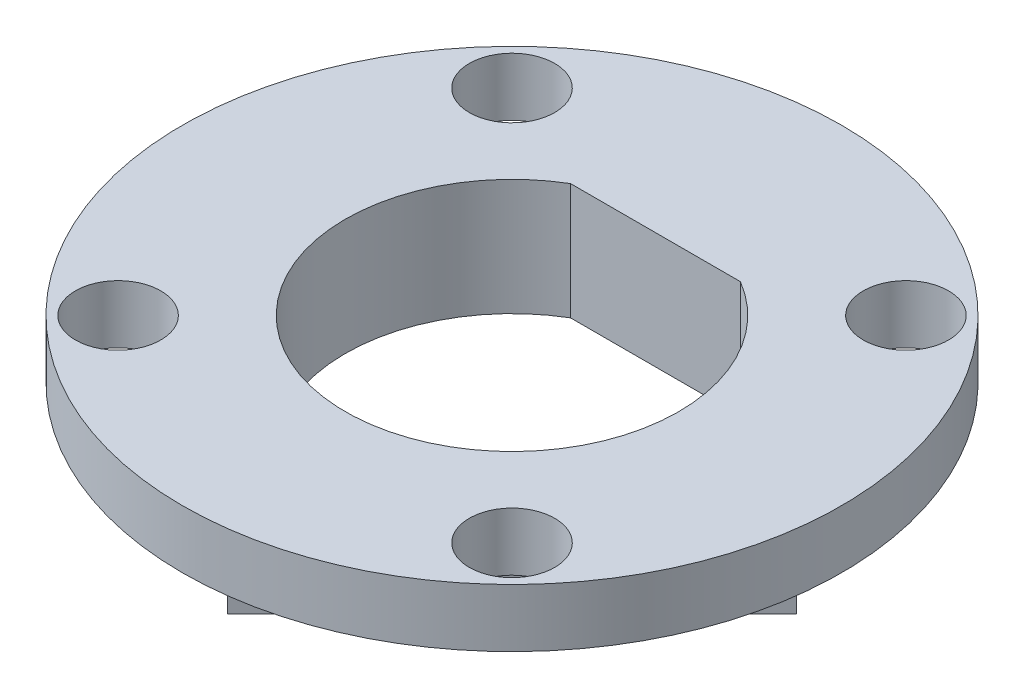
ISO-10303-21;
HEADER;
FILE_DESCRIPTION(('STEP AP214'),'2;1');
FILE_NAME('part.step','',(''),(''),'','','');
FILE_SCHEMA(('AUTOMOTIVE_DESIGN { 1 0 10303 214 1 1 1 1 }'));
ENDSEC;
DATA;
#1=APPLICATION_CONTEXT('core data for automotive mechanical design processes');
#2=APPLICATION_PROTOCOL_DEFINITION('international standard','automotive_design',2000,#1);
#3=PRODUCT_CONTEXT('',#1,'mechanical');
#4=PRODUCT('Part','Part','',(#3));
#5=PRODUCT_RELATED_PRODUCT_CATEGORY('part','',(#4));
#6=PRODUCT_DEFINITION_FORMATION('','',#4);
#7=PRODUCT_DEFINITION_CONTEXT('part definition',#1,'design');
#8=PRODUCT_DEFINITION('design','',#6,#7);
#9=PRODUCT_DEFINITION_SHAPE('','',#8);
#10=(LENGTH_UNIT() NAMED_UNIT(*) SI_UNIT(.MILLI.,.METRE.));
#11=(NAMED_UNIT(*) PLANE_ANGLE_UNIT() SI_UNIT($,.RADIAN.));
#12=(NAMED_UNIT(*) SI_UNIT($,.STERADIAN.) SOLID_ANGLE_UNIT());
#13=UNCERTAINTY_MEASURE_WITH_UNIT(LENGTH_MEASURE(1.E-05),#10,'distance_accuracy_value','');
#14=(GEOMETRIC_REPRESENTATION_CONTEXT(3) GLOBAL_UNCERTAINTY_ASSIGNED_CONTEXT((#13)) GLOBAL_UNIT_ASSIGNED_CONTEXT((#10,
#11,#12)) REPRESENTATION_CONTEXT('',''));
#15=CARTESIAN_POINT('',(0.,0.,0.));
#16=DIRECTION('',(0.,0.,1.));
#17=DIRECTION('',(1.,0.,0.));
#18=AXIS2_PLACEMENT_3D('',#15,#16,#17);
#19=CARTESIAN_POINT('',(0.,3.,0.));
#20=DIRECTION('',(0.,-1.,0.));
#21=DIRECTION('',(0.,0.,-1.));
#22=AXIS2_PLACEMENT_3D('',#19,#20,#21);
#23=CYLINDRICAL_SURFACE('',#22,8.5);
#24=CARTESIAN_POINT('',(0.,3.,0.));
#25=DIRECTION('',(0.,1.,0.));
#26=DIRECTION('',(0.,0.,1.));
#27=AXIS2_PLACEMENT_3D('',#24,#25,#26);
#28=CIRCLE('',#27,8.5);
#29=CARTESIAN_POINT('',(0.,3.,8.5));
#30=VERTEX_POINT('',#29);
#31=EDGE_CURVE('E157',#30,#30,#28,.T.);
#32=ORIENTED_EDGE('',*,*,#31,.F.);
#33=EDGE_LOOP('',(#32));
#34=FACE_BOUND('',#33,.T.);
#35=CARTESIAN_POINT('',(0.,1.5,0.));
#36=DIRECTION('',(0.,-1.,0.));
#37=DIRECTION('',(0.,0.,1.));
#38=AXIS2_PLACEMENT_3D('',#35,#36,#37);
#39=CIRCLE('',#38,8.5);
#40=CARTESIAN_POINT('',(0.,1.5,8.5));
#41=VERTEX_POINT('',#40);
#42=EDGE_CURVE('E124',#41,#41,#39,.T.);
#43=ORIENTED_EDGE('',*,*,#42,.F.);
#44=EDGE_LOOP('',(#43));
#45=FACE_BOUND('',#44,.T.);
#46=ADVANCED_FACE('F33',(#34,#45),#23,.T.);
#47=CARTESIAN_POINT('',(0.,3.,0.));
#48=DIRECTION('',(0.,1.,0.));
#49=DIRECTION('',(0.,0.,1.));
#50=AXIS2_PLACEMENT_3D('',#47,#48,#49);
#51=PLANE('',#50);
#52=CARTESIAN_POINT('',(-5.07999999999621,3.,-5.07999999999621));
#53=DIRECTION('',(0.,1.,0.));
#54=DIRECTION('',(0.,0.,1.));
#55=AXIS2_PLACEMENT_3D('',#52,#53,#54);
#56=CIRCLE('',#55,1.1);
#57=CARTESIAN_POINT('',(-5.07999999999621,3.,-3.97999999999621));
#58=VERTEX_POINT('',#57);
#59=EDGE_CURVE('E132',#58,#58,#56,.T.);
#60=ORIENTED_EDGE('',*,*,#59,.F.);
#61=EDGE_LOOP('',(#60));
#62=FACE_BOUND('',#61,.T.);
#63=CARTESIAN_POINT('',(5.07999999999621,3.,5.07999999999621));
#64=DIRECTION('',(0.,1.,0.));
#65=DIRECTION('',(0.,0.,1.));
#66=AXIS2_PLACEMENT_3D('',#63,#64,#65);
#67=CIRCLE('',#66,1.1);
#68=CARTESIAN_POINT('',(5.07999999999621,3.,6.17999999999621));
#69=VERTEX_POINT('',#68);
#70=EDGE_CURVE('E135',#69,#69,#67,.T.);
#71=ORIENTED_EDGE('',*,*,#70,.F.);
#72=EDGE_LOOP('',(#71));
#73=FACE_BOUND('',#72,.T.);
#74=CARTESIAN_POINT('',(-5.07999999999621,3.,5.07999999999621));
#75=DIRECTION('',(0.,1.,0.));
#76=DIRECTION('',(0.,0.,1.));
#77=AXIS2_PLACEMENT_3D('',#74,#75,#76);
#78=CIRCLE('',#77,1.1);
#79=CARTESIAN_POINT('',(-5.07999999999621,3.,6.17999999999621));
#80=VERTEX_POINT('',#79);
#81=EDGE_CURVE('E138',#80,#80,#78,.T.);
#82=ORIENTED_EDGE('',*,*,#81,.F.);
#83=EDGE_LOOP('',(#82));
#84=FACE_BOUND('',#83,.T.);
#85=CARTESIAN_POINT('',(5.07999999999621,3.,-5.07999999999621));
#86=DIRECTION('',(0.,1.,0.));
#87=DIRECTION('',(0.,0.,1.));
#88=AXIS2_PLACEMENT_3D('',#85,#86,#87);
#89=CIRCLE('',#88,1.1);
#90=CARTESIAN_POINT('',(5.07999999999621,3.,-3.97999999999621));
#91=VERTEX_POINT('',#90);
#92=EDGE_CURVE('E141',#91,#91,#89,.T.);
#93=ORIENTED_EDGE('',*,*,#92,.F.);
#94=EDGE_LOOP('',(#93));
#95=FACE_BOUND('',#94,.T.);
#96=CARTESIAN_POINT('',(0.,3.,0.));
#97=DIRECTION('',(0.,1.,0.));
#98=DIRECTION('',(0.,0.,1.));
#99=AXIS2_PLACEMENT_3D('',#96,#97,#98);
#100=CIRCLE('',#99,4.3);
#101=CARTESIAN_POINT('',(-2.19089023002066,3.,-3.7));
#102=VERTEX_POINT('',#101);
#103=CARTESIAN_POINT('',(2.19089023002066,3.,-3.7));
#104=VERTEX_POINT('',#103);
#105=EDGE_CURVE('E55',#102,#104,#100,.T.);
#106=ORIENTED_EDGE('',*,*,#105,.F.);
#107=DIRECTION('',(-1.,0.,0.));
#108=VECTOR('',#107,1.);
#109=CARTESIAN_POINT('',(-2.19089023002066,3.,-3.7));
#110=LINE('',#109,#108);
#111=EDGE_CURVE('E148',#104,#102,#110,.T.);
#112=ORIENTED_EDGE('',*,*,#111,.F.);
#113=EDGE_LOOP('',(#106,#112));
#114=FACE_BOUND('',#113,.T.);
#115=ORIENTED_EDGE('',*,*,#31,.T.);
#116=EDGE_LOOP('',(#115));
#117=FACE_BOUND('',#116,.T.);
#118=ADVANCED_FACE('F181',(#62,#73,#84,#95,#114,#117),#51,.T.);
#119=CARTESIAN_POINT('',(0.,0.,0.));
#120=DIRECTION('',(0.,1.,0.));
#121=DIRECTION('',(0.,0.,1.));
#122=AXIS2_PLACEMENT_3D('',#119,#120,#121);
#123=PLANE('',#122);
#124=DIRECTION('',(-1.,0.,0.));
#125=VECTOR('',#124,1.);
#126=CARTESIAN_POINT('',(-2.19089023002066,0.,-3.7));
#127=LINE('',#126,#125);
#128=CARTESIAN_POINT('',(2.19089023002066,0.,-3.7));
#129=VERTEX_POINT('',#128);
#130=CARTESIAN_POINT('',(-2.19089023002066,0.,-3.7));
#131=VERTEX_POINT('',#130);
#132=EDGE_CURVE('E147',#129,#131,#127,.T.);
#133=ORIENTED_EDGE('',*,*,#132,.T.);
#134=CARTESIAN_POINT('',(0.,0.,0.));
#135=DIRECTION('',(0.,1.,0.));
#136=DIRECTION('',(0.,0.,1.));
#137=AXIS2_PLACEMENT_3D('',#134,#135,#136);
#138=CIRCLE('',#137,4.3);
#139=EDGE_CURVE('E144',#131,#129,#138,.T.);
#140=ORIENTED_EDGE('',*,*,#139,.T.);
#141=EDGE_LOOP('',(#133,#140));
#142=FACE_BOUND('',#141,.T.);
#143=DIRECTION('',(-0.707106781186546,0.,-0.707106781186549));
#144=VECTOR('',#143,1.);
#145=CARTESIAN_POINT('',(-1.0973018246194,0.,-8.42887469984499));
#146=LINE('',#145,#144);
#147=CARTESIAN_POINT('',(7.33157287522555,0.,0.));
#148=VERTEX_POINT('',#147);
#149=CARTESIAN_POINT('',(0.,0.,-7.33157287522561));
#150=VERTEX_POINT('',#149);
#151=EDGE_CURVE('E87',#148,#150,#146,.T.);
#152=ORIENTED_EDGE('',*,*,#151,.F.);
#153=DIRECTION('',(0.707106781186546,0.,-0.707106781186549));
#154=VECTOR('',#153,1.);
#155=CARTESIAN_POINT('',(8.42887469984498,0.,-1.09730182461943));
#156=LINE('',#155,#154);
#157=CARTESIAN_POINT('',(0.,0.,7.33157287522558));
#158=VERTEX_POINT('',#157);
#159=EDGE_CURVE('E111',#158,#148,#156,.T.);
#160=ORIENTED_EDGE('',*,*,#159,.F.);
#161=DIRECTION('',(0.707106781186546,0.,0.707106781186549));
#162=VECTOR('',#161,1.);
#163=CARTESIAN_POINT('',(1.0973018246194,0.,8.42887469984499));
#164=LINE('',#163,#162);
#165=CARTESIAN_POINT('',(-7.33157287522553,0.,0.));
#166=VERTEX_POINT('',#165);
#167=EDGE_CURVE('E105',#166,#158,#164,.T.);
#168=ORIENTED_EDGE('',*,*,#167,.F.);
#169=DIRECTION('',(-0.707106781186541,0.,0.707106781186554));
#170=VECTOR('',#169,1.);
#171=CARTESIAN_POINT('',(-8.42887469984498,0.,1.09730182461949));
#172=LINE('',#171,#170);
#173=EDGE_CURVE('E47',#150,#166,#172,.T.);
#174=ORIENTED_EDGE('',*,*,#173,.F.);
#175=EDGE_LOOP('',(#152,#160,#168,#174));
#176=FACE_BOUND('',#175,.T.);
#177=ADVANCED_FACE('F103',(#142,#176),#123,.F.);
#178=CARTESIAN_POINT('',(0.,0.,0.));
#179=DIRECTION('',(0.,1.,0.));
#180=DIRECTION('',(0.,0.,1.));
#181=AXIS2_PLACEMENT_3D('',#178,#179,#180);
#182=CYLINDRICAL_SURFACE('',#181,4.3);
#183=ORIENTED_EDGE('',*,*,#105,.T.);
#184=DIRECTION('',(0.,1.,0.));
#185=VECTOR('',#184,1.);
#186=CARTESIAN_POINT('',(2.19089023002066,0.,-3.7));
#187=LINE('',#186,#185);
#188=EDGE_CURVE('E151',#129,#104,#187,.T.);
#189=ORIENTED_EDGE('',*,*,#188,.F.);
#190=ORIENTED_EDGE('',*,*,#139,.F.);
#191=DIRECTION('',(0.,1.,0.));
#192=VECTOR('',#191,1.);
#193=CARTESIAN_POINT('',(-2.19089023002066,0.,-3.7));
#194=LINE('',#193,#192);
#195=EDGE_CURVE('E155',#131,#102,#194,.T.);
#196=ORIENTED_EDGE('',*,*,#195,.T.);
#197=EDGE_LOOP('',(#183,#189,#190,#196));
#198=FACE_BOUND('',#197,.T.);
#199=ADVANCED_FACE('F215',(#198),#182,.F.);
#200=CARTESIAN_POINT('',(-2.19089023002066,0.,-3.7));
#201=DIRECTION('',(0.,0.,-1.));
#202=DIRECTION('',(-1.,0.,0.));
#203=AXIS2_PLACEMENT_3D('',#200,#201,#202);
#204=PLANE('',#203);
#205=ORIENTED_EDGE('',*,*,#111,.T.);
#206=ORIENTED_EDGE('',*,*,#195,.F.);
#207=ORIENTED_EDGE('',*,*,#132,.F.);
#208=ORIENTED_EDGE('',*,*,#188,.T.);
#209=EDGE_LOOP('',(#205,#206,#207,#208));
#210=FACE_BOUND('',#209,.T.);
#211=ADVANCED_FACE('F211',(#210),#204,.F.);
#212=CARTESIAN_POINT('',(5.07999999999621,0.,-5.07999999999621));
#213=DIRECTION('',(0.,1.,0.));
#214=DIRECTION('',(0.,0.,1.));
#215=AXIS2_PLACEMENT_3D('',#212,#213,#214);
#216=CYLINDRICAL_SURFACE('',#215,1.1);
#217=CARTESIAN_POINT('',(5.07999999999621,1.5,-5.07999999999621));
#218=DIRECTION('',(0.,1.,0.));
#219=DIRECTION('',(0.,0.,1.));
#220=AXIS2_PLACEMENT_3D('',#217,#218,#219);
#221=CIRCLE('',#220,1.1);
#222=CARTESIAN_POINT('',(5.07999999999621,1.5,-3.97999999999621));
#223=VERTEX_POINT('',#222);
#224=EDGE_CURVE('E121',#223,#223,#221,.F.);
#225=ORIENTED_EDGE('',*,*,#224,.T.);
#226=EDGE_LOOP('',(#225));
#227=FACE_BOUND('',#226,.T.);
#228=ORIENTED_EDGE('',*,*,#92,.T.);
#229=EDGE_LOOP('',(#228));
#230=FACE_BOUND('',#229,.T.);
#231=ADVANCED_FACE('F207',(#227,#230),#216,.F.);
#232=CARTESIAN_POINT('',(-5.07999999999621,0.,5.07999999999621));
#233=DIRECTION('',(0.,1.,0.));
#234=DIRECTION('',(0.,0.,1.));
#235=AXIS2_PLACEMENT_3D('',#232,#233,#234);
#236=CYLINDRICAL_SURFACE('',#235,1.1);
#237=CARTESIAN_POINT('',(-5.07999999999621,1.5,5.07999999999621));
#238=DIRECTION('',(0.,1.,0.));
#239=DIRECTION('',(0.,0.,1.));
#240=AXIS2_PLACEMENT_3D('',#237,#238,#239);
#241=CIRCLE('',#240,1.1);
#242=CARTESIAN_POINT('',(-5.07999999999621,1.5,6.17999999999621));
#243=VERTEX_POINT('',#242);
#244=EDGE_CURVE('E130',#243,#243,#241,.F.);
#245=ORIENTED_EDGE('',*,*,#244,.T.);
#246=EDGE_LOOP('',(#245));
#247=FACE_BOUND('',#246,.T.);
#248=ORIENTED_EDGE('',*,*,#81,.T.);
#249=EDGE_LOOP('',(#248));
#250=FACE_BOUND('',#249,.T.);
#251=ADVANCED_FACE('F203',(#247,#250),#236,.F.);
#252=CARTESIAN_POINT('',(5.07999999999621,0.,5.07999999999621));
#253=DIRECTION('',(0.,1.,0.));
#254=DIRECTION('',(0.,0.,1.));
#255=AXIS2_PLACEMENT_3D('',#252,#253,#254);
#256=CYLINDRICAL_SURFACE('',#255,1.1);
#257=CARTESIAN_POINT('',(5.07999999999621,1.5,5.07999999999621));
#258=DIRECTION('',(0.,1.,0.));
#259=DIRECTION('',(0.,0.,1.));
#260=AXIS2_PLACEMENT_3D('',#257,#258,#259);
#261=CIRCLE('',#260,1.1);
#262=CARTESIAN_POINT('',(5.07999999999621,1.5,6.17999999999621));
#263=VERTEX_POINT('',#262);
#264=EDGE_CURVE('E118',#263,#263,#261,.F.);
#265=ORIENTED_EDGE('',*,*,#264,.T.);
#266=EDGE_LOOP('',(#265));
#267=FACE_BOUND('',#266,.T.);
#268=ORIENTED_EDGE('',*,*,#70,.T.);
#269=EDGE_LOOP('',(#268));
#270=FACE_BOUND('',#269,.T.);
#271=ADVANCED_FACE('F197',(#267,#270),#256,.F.);
#272=CARTESIAN_POINT('',(-5.07999999999621,0.,-5.07999999999621));
#273=DIRECTION('',(0.,1.,0.));
#274=DIRECTION('',(0.,0.,1.));
#275=AXIS2_PLACEMENT_3D('',#272,#273,#274);
#276=CYLINDRICAL_SURFACE('',#275,1.1);
#277=CARTESIAN_POINT('',(-5.07999999999621,1.5,-5.07999999999621));
#278=DIRECTION('',(0.,1.,0.));
#279=DIRECTION('',(0.,0.,1.));
#280=AXIS2_PLACEMENT_3D('',#277,#278,#279);
#281=CIRCLE('',#280,1.1);
#282=CARTESIAN_POINT('',(-5.07999999999621,1.5,-3.97999999999621));
#283=VERTEX_POINT('',#282);
#284=EDGE_CURVE('E114',#283,#283,#281,.F.);
#285=ORIENTED_EDGE('',*,*,#284,.T.);
#286=EDGE_LOOP('',(#285));
#287=FACE_BOUND('',#286,.T.);
#288=ORIENTED_EDGE('',*,*,#59,.T.);
#289=EDGE_LOOP('',(#288));
#290=FACE_BOUND('',#289,.T.);
#291=ADVANCED_FACE('F193',(#287,#290),#276,.F.);
#292=CARTESIAN_POINT('',(0.,1.5,0.));
#293=DIRECTION('',(0.,1.,0.));
#294=DIRECTION('',(0.,0.,1.));
#295=AXIS2_PLACEMENT_3D('',#292,#293,#294);
#296=PLANE('',#295);
#297=ORIENTED_EDGE('',*,*,#42,.T.);
#298=EDGE_LOOP('',(#297));
#299=FACE_BOUND('',#298,.T.);
#300=DIRECTION('',(0.707106781186546,0.,0.707106781186549));
#301=VECTOR('',#300,1.);
#302=CARTESIAN_POINT('',(1.0973018246194,1.5,8.42887469984499));
#303=LINE('',#302,#301);
#304=CARTESIAN_POINT('',(-7.33157287522553,1.5,0.));
#305=VERTEX_POINT('',#304);
#306=CARTESIAN_POINT('',(0.,1.5,7.33157287522558));
#307=VERTEX_POINT('',#306);
#308=EDGE_CURVE('E127',#305,#307,#303,.T.);
#309=ORIENTED_EDGE('',*,*,#308,.T.);
#310=DIRECTION('',(0.707106781186546,0.,-0.707106781186549));
#311=VECTOR('',#310,1.);
#312=CARTESIAN_POINT('',(8.42887469984498,1.5,-1.09730182461943));
#313=LINE('',#312,#311);
#314=CARTESIAN_POINT('',(7.33157287522555,1.5,0.));
#315=VERTEX_POINT('',#314);
#316=EDGE_CURVE('E112',#307,#315,#313,.T.);
#317=ORIENTED_EDGE('',*,*,#316,.T.);
#318=DIRECTION('',(-0.707106781186546,0.,-0.707106781186549));
#319=VECTOR('',#318,1.);
#320=CARTESIAN_POINT('',(-1.0973018246194,1.5,-8.42887469984499));
#321=LINE('',#320,#319);
#322=CARTESIAN_POINT('',(0.,1.5,-7.33157287522561));
#323=VERTEX_POINT('',#322);
#324=EDGE_CURVE('E96',#315,#323,#321,.T.);
#325=ORIENTED_EDGE('',*,*,#324,.T.);
#326=DIRECTION('',(-0.707106781186541,0.,0.707106781186554));
#327=VECTOR('',#326,1.);
#328=CARTESIAN_POINT('',(-8.42887469984498,1.5,1.09730182461949));
#329=LINE('',#328,#327);
#330=EDGE_CURVE('E100',#323,#305,#329,.T.);
#331=ORIENTED_EDGE('',*,*,#330,.T.);
#332=EDGE_LOOP('',(#309,#317,#325,#331));
#333=FACE_BOUND('',#332,.T.);
#334=ORIENTED_EDGE('',*,*,#244,.F.);
#335=EDGE_LOOP('',(#334));
#336=FACE_BOUND('',#335,.T.);
#337=ORIENTED_EDGE('',*,*,#264,.F.);
#338=EDGE_LOOP('',(#337));
#339=FACE_BOUND('',#338,.T.);
#340=ORIENTED_EDGE('',*,*,#284,.F.);
#341=EDGE_LOOP('',(#340));
#342=FACE_BOUND('',#341,.T.);
#343=ORIENTED_EDGE('',*,*,#224,.F.);
#344=EDGE_LOOP('',(#343));
#345=FACE_BOUND('',#344,.T.);
#346=ADVANCED_FACE('F166',(#299,#333,#336,#339,#342,#345),#296,.F.);
#347=CARTESIAN_POINT('',(1.0973018246194,1.5,8.42887469984499));
#348=DIRECTION('',(0.707106781186549,0.,-0.707106781186546));
#349=DIRECTION('',(-0.707106781186546,0.,-0.707106781186549));
#350=AXIS2_PLACEMENT_3D('',#347,#348,#349);
#351=PLANE('',#350);
#352=ORIENTED_EDGE('',*,*,#167,.T.);
#353=DIRECTION('',(0.,1.,0.));
#354=VECTOR('',#353,1.);
#355=CARTESIAN_POINT('',(0.,1.5,7.33157287522558));
#356=LINE('',#355,#354);
#357=EDGE_CURVE('E11',#158,#307,#356,.T.);
#358=ORIENTED_EDGE('',*,*,#357,.T.);
#359=ORIENTED_EDGE('',*,*,#308,.F.);
#360=DIRECTION('',(0.,-1.,0.));
#361=VECTOR('',#360,1.);
#362=CARTESIAN_POINT('',(-7.33157287522553,1.5,0.));
#363=LINE('',#362,#361);
#364=EDGE_CURVE('E40',#305,#166,#363,.T.);
#365=ORIENTED_EDGE('',*,*,#364,.T.);
#366=EDGE_LOOP('',(#352,#358,#359,#365));
#367=FACE_BOUND('',#366,.T.);
#368=ADVANCED_FACE('F164',(#367),#351,.F.);
#369=CARTESIAN_POINT('',(8.42887469984498,1.5,-1.09730182461943));
#370=DIRECTION('',(-0.707106781186549,0.,-0.707106781186546));
#371=DIRECTION('',(-0.707106781186546,0.,0.707106781186549));
#372=AXIS2_PLACEMENT_3D('',#369,#370,#371);
#373=PLANE('',#372);
#374=ORIENTED_EDGE('',*,*,#159,.T.);
#375=DIRECTION('',(0.,1.,0.));
#376=VECTOR('',#375,1.);
#377=CARTESIAN_POINT('',(7.33157287522556,1.5,0.));
#378=LINE('',#377,#376);
#379=EDGE_CURVE('E93',#148,#315,#378,.T.);
#380=ORIENTED_EDGE('',*,*,#379,.T.);
#381=ORIENTED_EDGE('',*,*,#316,.F.);
#382=ORIENTED_EDGE('',*,*,#357,.F.);
#383=EDGE_LOOP('',(#374,#380,#381,#382));
#384=FACE_BOUND('',#383,.T.);
#385=ADVANCED_FACE('F169',(#384),#373,.F.);
#386=CARTESIAN_POINT('',(-8.42887469984498,1.5,1.09730182461949));
#387=DIRECTION('',(0.707106781186554,0.,0.707106781186541));
#388=DIRECTION('',(0.707106781186541,0.,-0.707106781186554));
#389=AXIS2_PLACEMENT_3D('',#386,#387,#388);
#390=PLANE('',#389);
#391=ORIENTED_EDGE('',*,*,#330,.F.);
#392=DIRECTION('',(0.,1.,0.));
#393=VECTOR('',#392,1.);
#394=CARTESIAN_POINT('',(0.,1.5,-7.33157287522561));
#395=LINE('',#394,#393);
#396=EDGE_CURVE('E90',#150,#323,#395,.T.);
#397=ORIENTED_EDGE('',*,*,#396,.F.);
#398=ORIENTED_EDGE('',*,*,#173,.T.);
#399=ORIENTED_EDGE('',*,*,#364,.F.);
#400=EDGE_LOOP('',(#391,#397,#398,#399));
#401=FACE_BOUND('',#400,.T.);
#402=ADVANCED_FACE('F98',(#401),#390,.F.);
#403=CARTESIAN_POINT('',(-1.0973018246194,1.5,-8.42887469984499));
#404=DIRECTION('',(-0.707106781186549,0.,0.707106781186546));
#405=DIRECTION('',(0.707106781186546,0.,0.707106781186549));
#406=AXIS2_PLACEMENT_3D('',#403,#404,#405);
#407=PLANE('',#406);
#408=ORIENTED_EDGE('',*,*,#151,.T.);
#409=ORIENTED_EDGE('',*,*,#396,.T.);
#410=ORIENTED_EDGE('',*,*,#324,.F.);
#411=ORIENTED_EDGE('',*,*,#379,.F.);
#412=EDGE_LOOP('',(#408,#409,#410,#411));
#413=FACE_BOUND('',#412,.T.);
#414=ADVANCED_FACE('F88',(#413),#407,.F.);
#415=CLOSED_SHELL('',(#46,#118,#177,#199,#211,#231,#251,#271,#291,#346,#368,#385,#402,#414));
#416=MANIFOLD_SOLID_BREP('B2',#415);
#417=ADVANCED_BREP_SHAPE_REPRESENTATION('',(#18,#416),#14);
#418=SHAPE_DEFINITION_REPRESENTATION(#9,#417);
ENDSEC;
END-ISO-10303-21;
